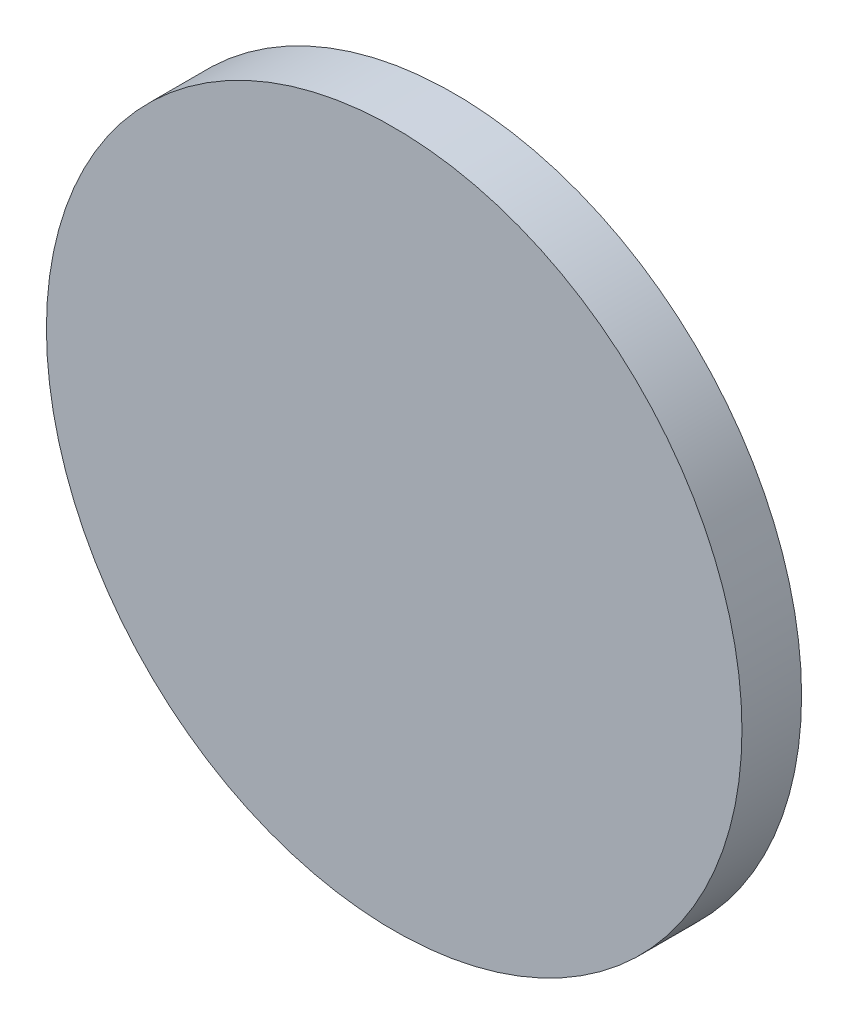
ISO-10303-21;
HEADER;
FILE_DESCRIPTION(('STEP AP214'),'2;1');
FILE_NAME('part.step','',(''),(''),'','','');
FILE_SCHEMA(('AUTOMOTIVE_DESIGN { 1 0 10303 214 1 1 1 1 }'));
ENDSEC;
DATA;
#1=APPLICATION_CONTEXT('core data for automotive mechanical design processes');
#2=APPLICATION_PROTOCOL_DEFINITION('international standard','automotive_design',2000,#1);
#3=PRODUCT_CONTEXT('',#1,'mechanical');
#4=PRODUCT('Part','Part','',(#3));
#5=PRODUCT_RELATED_PRODUCT_CATEGORY('part','',(#4));
#6=PRODUCT_DEFINITION_FORMATION('','',#4);
#7=PRODUCT_DEFINITION_CONTEXT('part definition',#1,'design');
#8=PRODUCT_DEFINITION('design','',#6,#7);
#9=PRODUCT_DEFINITION_SHAPE('','',#8);
#10=(LENGTH_UNIT() NAMED_UNIT(*) SI_UNIT(.MILLI.,.METRE.));
#11=(NAMED_UNIT(*) PLANE_ANGLE_UNIT() SI_UNIT($,.RADIAN.));
#12=(NAMED_UNIT(*) SI_UNIT($,.STERADIAN.) SOLID_ANGLE_UNIT());
#13=UNCERTAINTY_MEASURE_WITH_UNIT(LENGTH_MEASURE(1.E-05),#10,'distance_accuracy_value','');
#14=(GEOMETRIC_REPRESENTATION_CONTEXT(3) GLOBAL_UNCERTAINTY_ASSIGNED_CONTEXT((#13)) GLOBAL_UNIT_ASSIGNED_CONTEXT((#10,
#11,#12)) REPRESENTATION_CONTEXT('',''));
#15=CARTESIAN_POINT('',(0.,0.,0.));
#16=DIRECTION('',(0.,0.,1.));
#17=DIRECTION('',(1.,0.,0.));
#18=AXIS2_PLACEMENT_3D('',#15,#16,#17);
#19=CARTESIAN_POINT('',(8.084,9.76,0.));
#20=DIRECTION('',(0.,0.,-1.));
#21=DIRECTION('',(-1.,0.,0.));
#22=AXIS2_PLACEMENT_3D('',#19,#20,#21);
#23=PLANE('',#22);
#24=CARTESIAN_POINT('',(8.084,9.76,0.));
#25=DIRECTION('',(0.,0.,1.));
#26=DIRECTION('',(1.,0.,0.));
#27=AXIS2_PLACEMENT_3D('',#24,#25,#26);
#28=CIRCLE('',#27,0.200024667);
#29=CARTESIAN_POINT('',(8.284024667,9.76,0.));
#30=VERTEX_POINT('',#29);
#31=EDGE_CURVE('E18',#30,#30,#28,.T.);
#32=ORIENTED_EDGE('',*,*,#31,.F.);
#33=EDGE_LOOP('',(#32));
#34=FACE_BOUND('',#33,.T.);
#35=ADVANCED_FACE('F15',(#34),#23,.T.);
#36=CARTESIAN_POINT('',(8.084,9.76,0.));
#37=DIRECTION('',(0.,0.,1.));
#38=DIRECTION('',(1.,0.,0.));
#39=AXIS2_PLACEMENT_3D('',#36,#37,#38);
#40=CYLINDRICAL_SURFACE('',#39,0.200024667);
#41=CARTESIAN_POINT('',(8.084,9.76,0.03429));
#42=DIRECTION('',(0.,0.,1.));
#43=DIRECTION('',(1.,0.,0.));
#44=AXIS2_PLACEMENT_3D('',#41,#42,#43);
#45=CIRCLE('',#44,0.200024667);
#46=CARTESIAN_POINT('',(8.284024667,9.76,0.03429));
#47=VERTEX_POINT('',#46);
#48=EDGE_CURVE('E10',#47,#47,#45,.T.);
#49=ORIENTED_EDGE('',*,*,#48,.F.);
#50=EDGE_LOOP('',(#49));
#51=FACE_BOUND('',#50,.T.);
#52=ORIENTED_EDGE('',*,*,#31,.T.);
#53=EDGE_LOOP('',(#52));
#54=FACE_BOUND('',#53,.T.);
#55=ADVANCED_FACE('F27',(#51,#54),#40,.T.);
#56=CARTESIAN_POINT('',(8.084,9.76,0.03429));
#57=DIRECTION('',(0.,0.,1.));
#58=DIRECTION('',(1.,0.,0.));
#59=AXIS2_PLACEMENT_3D('',#56,#57,#58);
#60=PLANE('',#59);
#61=ORIENTED_EDGE('',*,*,#48,.T.);
#62=EDGE_LOOP('',(#61));
#63=FACE_BOUND('',#62,.T.);
#64=ADVANCED_FACE('F34',(#63),#60,.T.);
#65=CLOSED_SHELL('',(#35,#55,#64));
#66=MANIFOLD_SOLID_BREP('B1',#65);
#67=ADVANCED_BREP_SHAPE_REPRESENTATION('',(#18,#66),#14);
#68=SHAPE_DEFINITION_REPRESENTATION(#9,#67);
ENDSEC;
END-ISO-10303-21;
